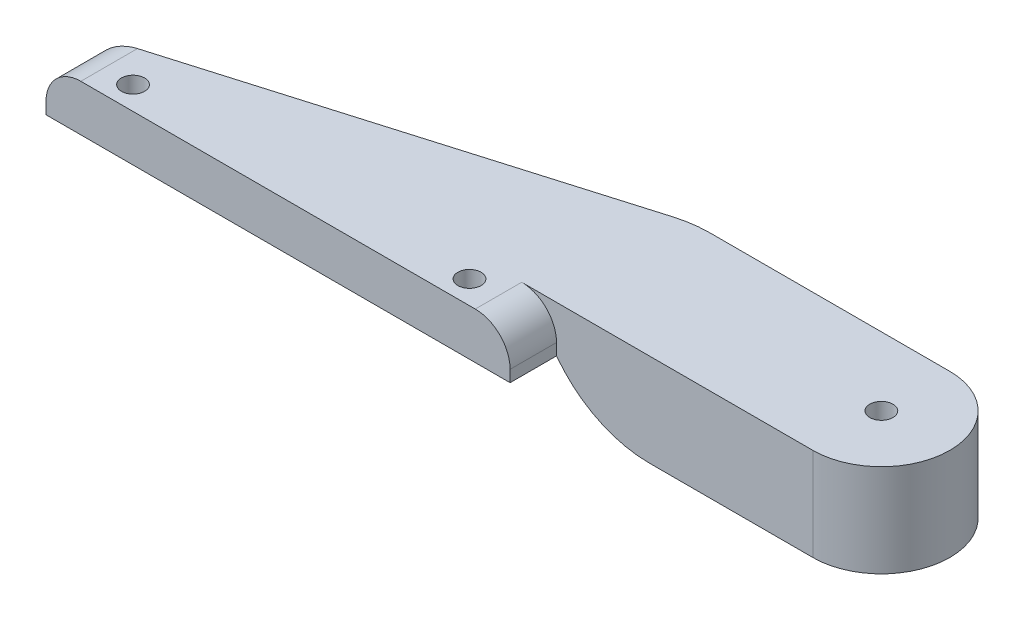
ISO-10303-21;
HEADER;
FILE_DESCRIPTION(('STEP AP214'),'2;1');
FILE_NAME('part.step','',(''),(''),'','','');
FILE_SCHEMA(('AUTOMOTIVE_DESIGN { 1 0 10303 214 1 1 1 1 }'));
ENDSEC;
DATA;
#1=APPLICATION_CONTEXT('core data for automotive mechanical design processes');
#2=APPLICATION_PROTOCOL_DEFINITION('international standard','automotive_design',2000,#1);
#3=PRODUCT_CONTEXT('',#1,'mechanical');
#4=PRODUCT('Part','Part','',(#3));
#5=PRODUCT_RELATED_PRODUCT_CATEGORY('part','',(#4));
#6=PRODUCT_DEFINITION_FORMATION('','',#4);
#7=PRODUCT_DEFINITION_CONTEXT('part definition',#1,'design');
#8=PRODUCT_DEFINITION('design','',#6,#7);
#9=PRODUCT_DEFINITION_SHAPE('','',#8);
#10=(LENGTH_UNIT() NAMED_UNIT(*) SI_UNIT(.MILLI.,.METRE.));
#11=(NAMED_UNIT(*) PLANE_ANGLE_UNIT() SI_UNIT($,.RADIAN.));
#12=(NAMED_UNIT(*) SI_UNIT($,.STERADIAN.) SOLID_ANGLE_UNIT());
#13=UNCERTAINTY_MEASURE_WITH_UNIT(LENGTH_MEASURE(1.E-05),#10,'distance_accuracy_value','');
#14=(GEOMETRIC_REPRESENTATION_CONTEXT(3) GLOBAL_UNCERTAINTY_ASSIGNED_CONTEXT((#13)) GLOBAL_UNIT_ASSIGNED_CONTEXT((#10,
#11,#12)) REPRESENTATION_CONTEXT('',''));
#15=CARTESIAN_POINT('',(0.,0.,0.));
#16=DIRECTION('',(0.,0.,1.));
#17=DIRECTION('',(1.,0.,0.));
#18=AXIS2_PLACEMENT_3D('',#15,#16,#17);
#19=CARTESIAN_POINT('',(20.,4.,-2.));
#20=DIRECTION('',(0.,0.,-1.));
#21=DIRECTION('',(-1.,0.,0.));
#22=AXIS2_PLACEMENT_3D('',#19,#20,#21);
#23=PLANE('',#22);
#24=DIRECTION('',(1.,0.,0.));
#25=VECTOR('',#24,1.);
#26=CARTESIAN_POINT('',(20.,4.,-2.));
#27=LINE('',#26,#25);
#28=CARTESIAN_POINT('',(17.,4.,-2.));
#29=VERTEX_POINT('',#28);
#30=CARTESIAN_POINT('',(42.1,4.,-2.));
#31=VERTEX_POINT('',#30);
#32=EDGE_CURVE('E205',#29,#31,#27,.T.);
#33=ORIENTED_EDGE('',*,*,#32,.F.);
#34=CARTESIAN_POINT('',(17.,1.,-2.));
#35=DIRECTION('',(0.,0.,-1.));
#36=DIRECTION('',(-1.,0.,0.));
#37=AXIS2_PLACEMENT_3D('',#34,#35,#36);
#38=CIRCLE('',#37,3.);
#39=CARTESIAN_POINT('',(20.,1.,-2.));
#40=VERTEX_POINT('',#39);
#41=EDGE_CURVE('E11',#29,#40,#38,.T.);
#42=ORIENTED_EDGE('',*,*,#41,.T.);
#43=DIRECTION('',(0.,-1.,0.));
#44=VECTOR('',#43,1.);
#45=CARTESIAN_POINT('',(20.,4.,-2.));
#46=LINE('',#45,#44);
#47=CARTESIAN_POINT('',(20.,0.,-2.));
#48=VERTEX_POINT('',#47);
#49=EDGE_CURVE('E220',#40,#48,#46,.T.);
#50=ORIENTED_EDGE('',*,*,#49,.T.);
#51=CARTESIAN_POINT('',(28.,6.,-2.));
#52=DIRECTION('',(0.,0.,-1.));
#53=DIRECTION('',(-1.,0.,0.));
#54=AXIS2_PLACEMENT_3D('',#51,#52,#53);
#55=CIRCLE('',#54,10.);
#56=CARTESIAN_POINT('',(28.,-4.,-2.));
#57=VERTEX_POINT('',#56);
#58=EDGE_CURVE('E356',#48,#57,#55,.F.);
#59=ORIENTED_EDGE('',*,*,#58,.T.);
#60=DIRECTION('',(-1.,0.,0.));
#61=VECTOR('',#60,1.);
#62=CARTESIAN_POINT('',(20.,-4.,-2.));
#63=LINE('',#62,#61);
#64=CARTESIAN_POINT('',(42.1,-4.,-2.));
#65=VERTEX_POINT('',#64);
#66=EDGE_CURVE('E199',#65,#57,#63,.T.);
#67=ORIENTED_EDGE('',*,*,#66,.F.);
#68=DIRECTION('',(0.,-1.,0.));
#69=VECTOR('',#68,1.);
#70=CARTESIAN_POINT('',(42.1,4.,-2.));
#71=LINE('',#70,#69);
#72=EDGE_CURVE('E241',#31,#65,#71,.T.);
#73=ORIENTED_EDGE('',*,*,#72,.F.);
#74=EDGE_LOOP('',(#33,#42,#50,#59,#67,#73));
#75=FACE_BOUND('',#74,.T.);
#76=ADVANCED_FACE('F33',(#75),#23,.F.);
#77=CARTESIAN_POINT('',(42.1,4.,-7.9));
#78=DIRECTION('',(0.,-1.,0.));
#79=DIRECTION('',(0.,0.,-1.));
#80=AXIS2_PLACEMENT_3D('',#77,#78,#79);
#81=CYLINDRICAL_SURFACE('',#80,5.9);
#82=ORIENTED_EDGE('',*,*,#72,.T.);
#83=CARTESIAN_POINT('',(42.1,-4.,-7.9));
#84=DIRECTION('',(0.,-1.,0.));
#85=DIRECTION('',(0.,0.,1.));
#86=AXIS2_PLACEMENT_3D('',#83,#84,#85);
#87=CIRCLE('',#86,5.9);
#88=CARTESIAN_POINT('',(42.1,-4.,-13.8));
#89=VERTEX_POINT('',#88);
#90=EDGE_CURVE('E196',#89,#65,#87,.T.);
#91=ORIENTED_EDGE('',*,*,#90,.F.);
#92=DIRECTION('',(0.,-1.,0.));
#93=VECTOR('',#92,1.);
#94=CARTESIAN_POINT('',(42.1,4.,-13.8));
#95=LINE('',#94,#93);
#96=CARTESIAN_POINT('',(42.1,4.,-13.8));
#97=VERTEX_POINT('',#96);
#98=EDGE_CURVE('E238',#97,#89,#95,.T.);
#99=ORIENTED_EDGE('',*,*,#98,.F.);
#100=CARTESIAN_POINT('',(42.1,4.,-7.9));
#101=DIRECTION('',(0.,1.,0.));
#102=DIRECTION('',(0.,0.,-1.));
#103=AXIS2_PLACEMENT_3D('',#100,#101,#102);
#104=CIRCLE('',#103,5.9);
#105=EDGE_CURVE('E208',#31,#97,#104,.T.);
#106=ORIENTED_EDGE('',*,*,#105,.F.);
#107=EDGE_LOOP('',(#82,#91,#99,#106));
#108=FACE_BOUND('',#107,.T.);
#109=ADVANCED_FACE('F313',(#108),#81,.T.);
#110=CARTESIAN_POINT('',(20.,4.,-13.8));
#111=DIRECTION('',(0.,0.,1.));
#112=DIRECTION('',(1.,0.,0.));
#113=AXIS2_PLACEMENT_3D('',#110,#111,#112);
#114=PLANE('',#113);
#115=CARTESIAN_POINT('',(28.,6.,-13.8));
#116=DIRECTION('',(0.,0.,1.));
#117=DIRECTION('',(1.,0.,0.));
#118=AXIS2_PLACEMENT_3D('',#115,#116,#117);
#119=CIRCLE('',#118,10.);
#120=CARTESIAN_POINT('',(28.,-4.,-13.8));
#121=VERTEX_POINT('',#120);
#122=CARTESIAN_POINT('',(21.4442342640121,-1.55128701711487,-13.8));
#123=VERTEX_POINT('',#122);
#124=EDGE_CURVE('E359',#121,#123,#119,.F.);
#125=ORIENTED_EDGE('',*,*,#124,.T.);
#126=DIRECTION('',(0.,-1.,0.));
#127=VECTOR('',#126,1.);
#128=CARTESIAN_POINT('',(21.4442342640121,4.,-13.8));
#129=LINE('',#128,#127);
#130=CARTESIAN_POINT('',(21.4442342640121,4.,-13.8));
#131=VERTEX_POINT('',#130);
#132=EDGE_CURVE('E337',#123,#131,#129,.F.);
#133=ORIENTED_EDGE('',*,*,#132,.T.);
#134=DIRECTION('',(-1.,0.,0.));
#135=VECTOR('',#134,1.);
#136=CARTESIAN_POINT('',(20.,4.,-13.8));
#137=LINE('',#136,#135);
#138=EDGE_CURVE('E211',#97,#131,#137,.T.);
#139=ORIENTED_EDGE('',*,*,#138,.F.);
#140=ORIENTED_EDGE('',*,*,#98,.T.);
#141=DIRECTION('',(1.,0.,0.));
#142=VECTOR('',#141,1.);
#143=CARTESIAN_POINT('',(20.,-4.,-13.8));
#144=LINE('',#143,#142);
#145=EDGE_CURVE('E194',#121,#89,#144,.T.);
#146=ORIENTED_EDGE('',*,*,#145,.F.);
#147=EDGE_LOOP('',(#125,#133,#139,#140,#146));
#148=FACE_BOUND('',#147,.T.);
#149=ADVANCED_FACE('F309',(#148),#114,.F.);
#150=CARTESIAN_POINT('',(-20.,4.,-2.));
#151=DIRECTION('',(0.282945147243684,0.,0.959136092351471));
#152=DIRECTION('',(0.959136092351471,0.,-0.282945147243684));
#153=AXIS2_PLACEMENT_3D('',#150,#151,#152);
#154=PLANE('',#153);
#155=DIRECTION('',(0.,-1.,0.));
#156=VECTOR('',#155,1.);
#157=CARTESIAN_POINT('',(-20.,4.,-2.));
#158=LINE('',#157,#156);
#159=CARTESIAN_POINT('',(-20.,1.,-2.));
#160=VERTEX_POINT('',#159);
#161=CARTESIAN_POINT('',(-20.,0.,-2.));
#162=VERTEX_POINT('',#161);
#163=EDGE_CURVE('E236',#160,#162,#158,.T.);
#164=ORIENTED_EDGE('',*,*,#163,.F.);
#165=CARTESIAN_POINT('',(-17.,1.,-2.885));
#166=DIRECTION('',(0.282945147243684,0.,0.959136092351471));
#167=DIRECTION('',(-0.959136092351471,0.,0.282945147243684));
#168=AXIS2_PLACEMENT_3D('',#165,#166,#167);
#169=ELLIPSE('',#168,3.12781473236507,3.);
#170=CARTESIAN_POINT('',(-17.,4.,-2.885));
#171=VERTEX_POINT('',#170);
#172=EDGE_CURVE('E345',#160,#171,#169,.F.);
#173=ORIENTED_EDGE('',*,*,#172,.T.);
#174=DIRECTION('',(-0.959136092351471,0.,0.282945147243684));
#175=VECTOR('',#174,1.);
#176=CARTESIAN_POINT('',(-20.,4.,-2.));
#177=LINE('',#176,#175);
#178=CARTESIAN_POINT('',(18.6147827915753,4.,-13.3913609235147));
#179=VERTEX_POINT('',#178);
#180=EDGE_CURVE('E214',#179,#171,#177,.T.);
#181=ORIENTED_EDGE('',*,*,#180,.F.);
#182=DIRECTION('',(0.,-1.,0.));
#183=VECTOR('',#182,1.);
#184=CARTESIAN_POINT('',(18.6147827915753,4.,-13.3913609235147));
#185=LINE('',#184,#183);
#186=CARTESIAN_POINT('',(18.6147827915753,0.,-13.3913609235147));
#187=VERTEX_POINT('',#186);
#188=EDGE_CURVE('E358',#179,#187,#185,.T.);
#189=ORIENTED_EDGE('',*,*,#188,.T.);
#190=DIRECTION('',(-0.959136092351471,0.,0.282945147243684));
#191=VECTOR('',#190,1.);
#192=CARTESIAN_POINT('',(-20.,0.,-2.));
#193=LINE('',#192,#191);
#194=EDGE_CURVE('E202',#187,#162,#193,.T.);
#195=ORIENTED_EDGE('',*,*,#194,.T.);
#196=EDGE_LOOP('',(#164,#173,#181,#189,#195));
#197=FACE_BOUND('',#196,.T.);
#198=ADVANCED_FACE('F306',(#197),#154,.F.);
#199=CARTESIAN_POINT('',(-20.,4.,2.));
#200=DIRECTION('',(1.,0.,0.));
#201=DIRECTION('',(0.,0.,-1.));
#202=AXIS2_PLACEMENT_3D('',#199,#200,#201);
#203=PLANE('',#202);
#204=DIRECTION('',(0.,-1.,0.));
#205=VECTOR('',#204,1.);
#206=CARTESIAN_POINT('',(-20.,4.,2.));
#207=LINE('',#206,#205);
#208=CARTESIAN_POINT('',(-20.,1.,2.));
#209=VERTEX_POINT('',#208);
#210=CARTESIAN_POINT('',(-20.,0.,2.));
#211=VERTEX_POINT('',#210);
#212=EDGE_CURVE('E234',#209,#211,#207,.T.);
#213=ORIENTED_EDGE('',*,*,#212,.F.);
#214=DIRECTION('',(0.,0.,1.));
#215=VECTOR('',#214,1.);
#216=CARTESIAN_POINT('',(-20.,1.,2.));
#217=LINE('',#216,#215);
#218=EDGE_CURVE('E54',#209,#160,#217,.F.);
#219=ORIENTED_EDGE('',*,*,#218,.T.);
#220=ORIENTED_EDGE('',*,*,#163,.T.);
#221=DIRECTION('',(0.,0.,1.));
#222=VECTOR('',#221,1.);
#223=CARTESIAN_POINT('',(-20.,0.,2.));
#224=LINE('',#223,#222);
#225=EDGE_CURVE('E223',#162,#211,#224,.T.);
#226=ORIENTED_EDGE('',*,*,#225,.T.);
#227=EDGE_LOOP('',(#213,#219,#220,#226));
#228=FACE_BOUND('',#227,.T.);
#229=ADVANCED_FACE('F302',(#228),#203,.F.);
#230=CARTESIAN_POINT('',(-20.,4.,2.));
#231=DIRECTION('',(0.,0.,-1.));
#232=DIRECTION('',(-1.,0.,0.));
#233=AXIS2_PLACEMENT_3D('',#230,#231,#232);
#234=PLANE('',#233);
#235=DIRECTION('',(1.,0.,0.));
#236=VECTOR('',#235,1.);
#237=CARTESIAN_POINT('',(-20.,4.,2.));
#238=LINE('',#237,#236);
#239=CARTESIAN_POINT('',(-17.,4.,2.));
#240=VERTEX_POINT('',#239);
#241=CARTESIAN_POINT('',(17.,4.,2.));
#242=VERTEX_POINT('',#241);
#243=EDGE_CURVE('E217',#240,#242,#238,.T.);
#244=ORIENTED_EDGE('',*,*,#243,.F.);
#245=CARTESIAN_POINT('',(-17.,1.,2.));
#246=DIRECTION('',(0.,0.,-1.));
#247=DIRECTION('',(-1.,0.,0.));
#248=AXIS2_PLACEMENT_3D('',#245,#246,#247);
#249=CIRCLE('',#248,3.);
#250=EDGE_CURVE('E342',#240,#209,#249,.F.);
#251=ORIENTED_EDGE('',*,*,#250,.T.);
#252=ORIENTED_EDGE('',*,*,#212,.T.);
#253=DIRECTION('',(1.,0.,0.));
#254=VECTOR('',#253,1.);
#255=CARTESIAN_POINT('',(-20.,0.,2.));
#256=LINE('',#255,#254);
#257=CARTESIAN_POINT('',(20.,0.,2.));
#258=VERTEX_POINT('',#257);
#259=EDGE_CURVE('E226',#211,#258,#256,.T.);
#260=ORIENTED_EDGE('',*,*,#259,.T.);
#261=DIRECTION('',(0.,-1.,0.));
#262=VECTOR('',#261,1.);
#263=CARTESIAN_POINT('',(20.,4.,2.));
#264=LINE('',#263,#262);
#265=CARTESIAN_POINT('',(20.,1.,2.));
#266=VERTEX_POINT('',#265);
#267=EDGE_CURVE('E232',#266,#258,#264,.T.);
#268=ORIENTED_EDGE('',*,*,#267,.F.);
#269=CARTESIAN_POINT('',(17.,1.,2.));
#270=DIRECTION('',(0.,0.,-1.));
#271=DIRECTION('',(-1.,0.,0.));
#272=AXIS2_PLACEMENT_3D('',#269,#270,#271);
#273=CIRCLE('',#272,3.);
#274=EDGE_CURVE('E335',#266,#242,#273,.F.);
#275=ORIENTED_EDGE('',*,*,#274,.T.);
#276=EDGE_LOOP('',(#244,#251,#252,#260,#268,#275));
#277=FACE_BOUND('',#276,.T.);
#278=ADVANCED_FACE('F298',(#277),#234,.F.);
#279=CARTESIAN_POINT('',(20.,4.,2.));
#280=DIRECTION('',(-1.,0.,0.));
#281=DIRECTION('',(0.,0.,1.));
#282=AXIS2_PLACEMENT_3D('',#279,#280,#281);
#283=PLANE('',#282);
#284=ORIENTED_EDGE('',*,*,#49,.F.);
#285=DIRECTION('',(0.,0.,-1.));
#286=VECTOR('',#285,1.);
#287=CARTESIAN_POINT('',(20.,1.,2.));
#288=LINE('',#287,#286);
#289=EDGE_CURVE('E41',#40,#266,#288,.F.);
#290=ORIENTED_EDGE('',*,*,#289,.T.);
#291=ORIENTED_EDGE('',*,*,#267,.T.);
#292=DIRECTION('',(0.,0.,-1.));
#293=VECTOR('',#292,1.);
#294=CARTESIAN_POINT('',(20.,0.,2.));
#295=LINE('',#294,#293);
#296=EDGE_CURVE('E209',#258,#48,#295,.T.);
#297=ORIENTED_EDGE('',*,*,#296,.T.);
#298=EDGE_LOOP('',(#284,#290,#291,#297));
#299=FACE_BOUND('',#298,.T.);
#300=ADVANCED_FACE('F291',(#299),#283,.F.);
#301=CARTESIAN_POINT('',(42.1,4.,-7.9));
#302=DIRECTION('',(0.,-1.,0.));
#303=DIRECTION('',(0.,0.,-1.));
#304=AXIS2_PLACEMENT_3D('',#301,#302,#303);
#305=PLANE('',#304);
#306=CARTESIAN_POINT('',(14.5,4.,0.));
#307=DIRECTION('',(0.,1.,0.));
#308=DIRECTION('',(0.,0.,1.));
#309=AXIS2_PLACEMENT_3D('',#306,#307,#308);
#310=CIRCLE('',#309,1.);
#311=CARTESIAN_POINT('',(14.5,4.,1.));
#312=VERTEX_POINT('',#311);
#313=EDGE_CURVE('E251',#312,#312,#310,.T.);
#314=ORIENTED_EDGE('',*,*,#313,.F.);
#315=EDGE_LOOP('',(#314));
#316=FACE_BOUND('',#315,.T.);
#317=CARTESIAN_POINT('',(-14.5,4.,0.));
#318=DIRECTION('',(0.,1.,0.));
#319=DIRECTION('',(0.,0.,1.));
#320=AXIS2_PLACEMENT_3D('',#317,#318,#319);
#321=CIRCLE('',#320,1.);
#322=CARTESIAN_POINT('',(-14.5,4.,1.));
#323=VERTEX_POINT('',#322);
#324=EDGE_CURVE('E247',#323,#323,#321,.T.);
#325=ORIENTED_EDGE('',*,*,#324,.F.);
#326=EDGE_LOOP('',(#325));
#327=FACE_BOUND('',#326,.T.);
#328=CARTESIAN_POINT('',(42.1,4.,-7.9));
#329=DIRECTION('',(0.,-1.,0.));
#330=DIRECTION('',(0.,0.,-1.));
#331=AXIS2_PLACEMENT_3D('',#328,#329,#330);
#332=CIRCLE('',#331,0.999999999999998);
#333=CARTESIAN_POINT('',(42.1,4.,-8.9));
#334=VERTEX_POINT('',#333);
#335=EDGE_CURVE('E185',#334,#334,#332,.T.);
#336=ORIENTED_EDGE('',*,*,#335,.T.);
#337=EDGE_LOOP('',(#336));
#338=FACE_BOUND('',#337,.T.);
#339=ORIENTED_EDGE('',*,*,#180,.T.);
#340=DIRECTION('',(0.,0.,1.));
#341=VECTOR('',#340,1.);
#342=CARTESIAN_POINT('',(-17.,4.,-7.9));
#343=LINE('',#342,#341);
#344=EDGE_CURVE('E332',#171,#240,#343,.T.);
#345=ORIENTED_EDGE('',*,*,#344,.T.);
#346=ORIENTED_EDGE('',*,*,#243,.T.);
#347=DIRECTION('',(0.,0.,-1.));
#348=VECTOR('',#347,1.);
#349=CARTESIAN_POINT('',(17.,4.,-7.9));
#350=LINE('',#349,#348);
#351=EDGE_CURVE('E329',#242,#29,#350,.T.);
#352=ORIENTED_EDGE('',*,*,#351,.T.);
#353=ORIENTED_EDGE('',*,*,#32,.T.);
#354=ORIENTED_EDGE('',*,*,#105,.T.);
#355=ORIENTED_EDGE('',*,*,#138,.T.);
#356=CARTESIAN_POINT('',(21.4442342640121,4.,-3.8));
#357=DIRECTION('',(0.,-1.,0.));
#358=DIRECTION('',(0.,0.,-1.));
#359=AXIS2_PLACEMENT_3D('',#356,#357,#358);
#360=CIRCLE('',#359,10.);
#361=EDGE_CURVE('E333',#131,#179,#360,.F.);
#362=ORIENTED_EDGE('',*,*,#361,.T.);
#363=EDGE_LOOP('',(#339,#345,#346,#352,#353,#354,#355,#362));
#364=FACE_BOUND('',#363,.T.);
#365=ADVANCED_FACE('F288',(#316,#327,#338,#364),#305,.F.);
#366=CARTESIAN_POINT('',(42.1,0.,-7.9));
#367=DIRECTION('',(0.,-1.,0.));
#368=DIRECTION('',(0.,0.,-1.));
#369=AXIS2_PLACEMENT_3D('',#366,#367,#368);
#370=PLANE('',#369);
#371=CARTESIAN_POINT('',(14.5,0.,0.));
#372=DIRECTION('',(0.,-1.,0.));
#373=DIRECTION('',(0.,0.,-1.));
#374=AXIS2_PLACEMENT_3D('',#371,#372,#373);
#375=CIRCLE('',#374,1.);
#376=CARTESIAN_POINT('',(14.5,0.,-0.999999999999999));
#377=VERTEX_POINT('',#376);
#378=EDGE_CURVE('E248',#377,#377,#375,.T.);
#379=ORIENTED_EDGE('',*,*,#378,.F.);
#380=EDGE_LOOP('',(#379));
#381=FACE_BOUND('',#380,.T.);
#382=CARTESIAN_POINT('',(-14.5,0.,0.));
#383=DIRECTION('',(0.,-1.,0.));
#384=DIRECTION('',(0.,0.,-1.));
#385=AXIS2_PLACEMENT_3D('',#382,#383,#384);
#386=CIRCLE('',#385,1.);
#387=CARTESIAN_POINT('',(-14.5,0.,-0.999999999999995));
#388=VERTEX_POINT('',#387);
#389=EDGE_CURVE('E244',#388,#388,#386,.T.);
#390=ORIENTED_EDGE('',*,*,#389,.F.);
#391=EDGE_LOOP('',(#390));
#392=FACE_BOUND('',#391,.T.);
#393=ORIENTED_EDGE('',*,*,#194,.F.);
#394=CARTESIAN_POINT('',(21.4442342640121,0.,-3.8));
#395=DIRECTION('',(0.,-1.,0.));
#396=DIRECTION('',(0.,0.,-1.));
#397=AXIS2_PLACEMENT_3D('',#394,#395,#396);
#398=CIRCLE('',#397,10.);
#399=CARTESIAN_POINT('',(20.,0.,-13.6951597961151));
#400=VERTEX_POINT('',#399);
#401=EDGE_CURVE('E362',#187,#400,#398,.T.);
#402=ORIENTED_EDGE('',*,*,#401,.T.);
#403=DIRECTION('',(0.,0.,-1.));
#404=VECTOR('',#403,1.);
#405=CARTESIAN_POINT('',(20.,0.,-2.));
#406=LINE('',#405,#404);
#407=EDGE_CURVE('E189',#48,#400,#406,.T.);
#408=ORIENTED_EDGE('',*,*,#407,.F.);
#409=ORIENTED_EDGE('',*,*,#296,.F.);
#410=ORIENTED_EDGE('',*,*,#259,.F.);
#411=ORIENTED_EDGE('',*,*,#225,.F.);
#412=EDGE_LOOP('',(#393,#402,#408,#409,#410,#411));
#413=FACE_BOUND('',#412,.T.);
#414=ADVANCED_FACE('F286',(#381,#392,#413),#370,.T.);
#415=CARTESIAN_POINT('',(42.1,-4.,-7.9));
#416=DIRECTION('',(0.,1.,0.));
#417=DIRECTION('',(0.,0.,1.));
#418=AXIS2_PLACEMENT_3D('',#415,#416,#417);
#419=PLANE('',#418);
#420=ORIENTED_EDGE('',*,*,#66,.T.);
#421=DIRECTION('',(0.,0.,-1.));
#422=VECTOR('',#421,1.);
#423=CARTESIAN_POINT('',(28.,-4.,-7.9));
#424=LINE('',#423,#422);
#425=CARTESIAN_POINT('',(28.,-4.,-5.90552618459344));
#426=VERTEX_POINT('',#425);
#427=EDGE_CURVE('E253',#57,#426,#424,.T.);
#428=ORIENTED_EDGE('',*,*,#427,.T.);
#429=DIRECTION('',(-0.996448898518601,0.,-0.0841997187707063));
#430=VECTOR('',#429,1.);
#431=CARTESIAN_POINT('',(39.8997482853627,-4.,-4.90000000000001));
#432=LINE('',#431,#430);
#433=CARTESIAN_POINT('',(39.8997482853627,-4.,-4.90000000000001));
#434=VERTEX_POINT('',#433);
#435=EDGE_CURVE('E176',#434,#426,#432,.T.);
#436=ORIENTED_EDGE('',*,*,#435,.F.);
#437=CARTESIAN_POINT('',(42.1,-4.,-7.9));
#438=DIRECTION('',(0.,-1.,0.));
#439=DIRECTION('',(0.,0.,1.));
#440=AXIS2_PLACEMENT_3D('',#437,#438,#439);
#441=CIRCLE('',#440,3.72036390797518);
#442=CARTESIAN_POINT('',(39.8677816552149,-4.,-10.8762911263801));
#443=VERTEX_POINT('',#442);
#444=EDGE_CURVE('E156',#443,#434,#441,.T.);
#445=ORIENTED_EDGE('',*,*,#444,.F.);
#446=DIRECTION('',(0.996595142359569,0.,-0.0824507260447701));
#447=VECTOR('',#446,1.);
#448=CARTESIAN_POINT('',(27.9813488478213,-4.,-9.8928977970372));
#449=LINE('',#448,#447);
#450=CARTESIAN_POINT('',(28.,-4.,-9.89444085195824));
#451=VERTEX_POINT('',#450);
#452=EDGE_CURVE('E174',#451,#443,#449,.T.);
#453=ORIENTED_EDGE('',*,*,#452,.F.);
#454=DIRECTION('',(0.,0.,-1.));
#455=VECTOR('',#454,1.);
#456=CARTESIAN_POINT('',(28.,-4.,-7.9));
#457=LINE('',#456,#455);
#458=EDGE_CURVE('E243',#451,#121,#457,.T.);
#459=ORIENTED_EDGE('',*,*,#458,.T.);
#460=ORIENTED_EDGE('',*,*,#145,.T.);
#461=ORIENTED_EDGE('',*,*,#90,.T.);
#462=EDGE_LOOP('',(#420,#428,#436,#445,#453,#459,#460,#461));
#463=FACE_BOUND('',#462,.T.);
#464=ADVANCED_FACE('F283',(#463),#419,.F.);
#465=CARTESIAN_POINT('',(42.1,0.,-7.9));
#466=DIRECTION('',(0.,-1.,0.));
#467=DIRECTION('',(0.,0.,-1.));
#468=AXIS2_PLACEMENT_3D('',#465,#466,#467);
#469=CYLINDRICAL_SURFACE('',#468,3.72036390797518);
#470=ORIENTED_EDGE('',*,*,#444,.T.);
#471=DIRECTION('',(0.,-1.,0.));
#472=VECTOR('',#471,1.);
#473=CARTESIAN_POINT('',(39.8997482853627,0.,-4.90000000000001));
#474=LINE('',#473,#472);
#475=CARTESIAN_POINT('',(39.8997482853627,0.,-4.90000000000001));
#476=VERTEX_POINT('',#475);
#477=EDGE_CURVE('E148',#476,#434,#474,.T.);
#478=ORIENTED_EDGE('',*,*,#477,.F.);
#479=CARTESIAN_POINT('',(42.1,0.,-7.9));
#480=DIRECTION('',(0.,-1.,0.));
#481=DIRECTION('',(0.,0.,1.));
#482=AXIS2_PLACEMENT_3D('',#479,#480,#481);
#483=CIRCLE('',#482,3.72036390797518);
#484=CARTESIAN_POINT('',(39.8677816552149,0.,-10.8762911263801));
#485=VERTEX_POINT('',#484);
#486=EDGE_CURVE('E153',#485,#476,#483,.T.);
#487=ORIENTED_EDGE('',*,*,#486,.F.);
#488=DIRECTION('',(0.,-1.,0.));
#489=VECTOR('',#488,1.);
#490=CARTESIAN_POINT('',(39.8677816552149,0.,-10.8762911263801));
#491=LINE('',#490,#489);
#492=EDGE_CURVE('E187',#485,#443,#491,.T.);
#493=ORIENTED_EDGE('',*,*,#492,.T.);
#494=EDGE_LOOP('',(#470,#478,#487,#493));
#495=FACE_BOUND('',#494,.T.);
#496=ADVANCED_FACE('F150',(#495),#469,.F.);
#497=CARTESIAN_POINT('',(27.9813488478213,0.,-9.8928977970372));
#498=DIRECTION('',(-0.0824507260447701,0.,-0.996595142359569));
#499=DIRECTION('',(-0.996595142359569,0.,0.0824507260447701));
#500=AXIS2_PLACEMENT_3D('',#497,#498,#499);
#501=PLANE('',#500);
#502=DIRECTION('',(0.,-1.,0.));
#503=VECTOR('',#502,1.);
#504=CARTESIAN_POINT('',(27.9813488478213,0.,-9.8928977970372));
#505=LINE('',#504,#503);
#506=CARTESIAN_POINT('',(27.9813488478213,0.,-9.8928977970372));
#507=VERTEX_POINT('',#506);
#508=CARTESIAN_POINT('',(27.9813488478213,-3.999982606711,-9.8928977970372));
#509=VERTEX_POINT('',#508);
#510=EDGE_CURVE('E190',#507,#509,#505,.T.);
#511=ORIENTED_EDGE('',*,*,#510,.T.);
#512=CARTESIAN_POINT('',(28.,6.,-9.89444085195824));
#513=DIRECTION('',(-0.0824507260447701,0.,-0.996595142359569));
#514=DIRECTION('',(0.996595142359569,0.,-0.0824507260447701));
#515=AXIS2_PLACEMENT_3D('',#512,#513,#514);
#516=ELLIPSE('',#515,10.0341649030354,10.);
#517=EDGE_CURVE('E265',#509,#451,#516,.F.);
#518=ORIENTED_EDGE('',*,*,#517,.T.);
#519=ORIENTED_EDGE('',*,*,#452,.T.);
#520=ORIENTED_EDGE('',*,*,#492,.F.);
#521=DIRECTION('',(0.996595142359569,0.,-0.0824507260447701));
#522=VECTOR('',#521,1.);
#523=CARTESIAN_POINT('',(27.9813488478213,0.,-9.8928977970372));
#524=LINE('',#523,#522);
#525=EDGE_CURVE('E161',#507,#485,#524,.T.);
#526=ORIENTED_EDGE('',*,*,#525,.F.);
#527=EDGE_LOOP('',(#511,#518,#519,#520,#526));
#528=FACE_BOUND('',#527,.T.);
#529=ADVANCED_FACE('F276',(#528),#501,.F.);
#530=CARTESIAN_POINT('',(27.9813488478213,0.,-7.9));
#531=DIRECTION('',(0.,-1.,0.));
#532=DIRECTION('',(0.,0.,-1.));
#533=AXIS2_PLACEMENT_3D('',#530,#531,#532);
#534=CYLINDRICAL_SURFACE('',#533,1.9928977970372);
#535=DIRECTION('',(0.,-1.,0.));
#536=VECTOR('',#535,1.);
#537=CARTESIAN_POINT('',(27.9813488478213,0.,-5.9071022029628));
#538=LINE('',#537,#536);
#539=CARTESIAN_POINT('',(27.9813488478213,0.,-5.9071022029628));
#540=VERTEX_POINT('',#539);
#541=CARTESIAN_POINT('',(27.9813488478213,-3.99998260671099,-5.9071022029628));
#542=VERTEX_POINT('',#541);
#543=EDGE_CURVE('E160',#540,#542,#538,.T.);
#544=ORIENTED_EDGE('',*,*,#543,.T.);
#545=CARTESIAN_POINT('',(27.9813488478213,-3.99998260671099,-5.9071022029628));
#546=CARTESIAN_POINT('',(27.9258510275741,-3.99988165396656,-5.90710194102415));
#547=CARTESIAN_POINT('',(27.8703812202983,-3.99931306187351,-5.90942191006826));
#548=CARTESIAN_POINT('',(27.7598508801047,-3.99726843852848,-5.91867260954471));
#549=CARTESIAN_POINT('',(27.7047902990594,-3.99579251574957,-5.92560278882594));
#550=CARTESIAN_POINT('',(27.5409921553846,-3.99005439887119,-5.95322110566567));
#551=CARTESIAN_POINT('',(27.4333711140772,-3.98448110248227,-5.98073735239698));
#552=CARTESIAN_POINT('',(27.2243964088102,-3.97042836828233,-6.05313416238933));
#553=CARTESIAN_POINT('',(27.1230435526733,-3.9619485568069,-6.09801695840649));
#554=CARTESIAN_POINT('',(26.9292836246916,-3.94298979104082,-6.20383338779688));
#555=CARTESIAN_POINT('',(26.8368773619399,-3.93251065619373,-6.26476847102181));
#556=CARTESIAN_POINT('',(26.6624196340006,-3.91053563107475,-6.40182677692127));
#557=CARTESIAN_POINT('',(26.5805066309352,-3.89902899415347,-6.47812446221077));
#558=CARTESIAN_POINT('',(26.4305462218908,-3.87636467969978,-6.64337609969289));
#559=CARTESIAN_POINT('',(26.3625010989788,-3.86520705988153,-6.73233213174029));
#560=CARTESIAN_POINT('',(26.2416418722682,-3.84438846062123,-6.92135064324997));
#561=CARTESIAN_POINT('',(26.1889684630977,-3.83474165916513,-7.02150477831095));
#562=CARTESIAN_POINT('',(26.1012550535045,-3.81818581909149,-7.22946329071962));
#563=CARTESIAN_POINT('',(26.0662123109566,-3.81127635476719,-7.33726647542083));
#564=CARTESIAN_POINT('',(26.0152099968558,-3.80108578775166,-7.55594238789587));
#565=CARTESIAN_POINT('',(25.9990017494893,-3.79775744732315,-7.66675487157657));
#566=CARTESIAN_POINT('',(25.9853556592355,-3.79496096083764,-7.88957510642981));
#567=CARTESIAN_POINT('',(25.9879163177958,-3.79549250659849,-8.00158276146413));
#568=CARTESIAN_POINT('',(26.0115368713923,-3.80031381647305,-8.22181102815697));
#569=CARTESIAN_POINT('',(26.0323147346988,-3.80454628171638,-8.33006332978189));
#570=CARTESIAN_POINT('',(26.0913347123552,-3.81620565111392,-8.54151264181261));
#571=CARTESIAN_POINT('',(26.1295775364254,-3.82363268508447,-8.64470944659046));
#572=CARTESIAN_POINT('',(26.2227120372125,-3.84090922650513,-8.84393506649912));
#573=CARTESIAN_POINT('',(26.2777159482339,-3.85077497711707,-8.93990994710387));
#574=CARTESIAN_POINT('',(26.4027293747535,-3.87181503424319,-9.12136975261098));
#575=CARTESIAN_POINT('',(26.4727401414134,-3.88298944982902,-9.20685380192956));
#576=CARTESIAN_POINT('',(26.6272840916004,-3.90564724024965,-9.36653241589454));
#577=CARTESIAN_POINT('',(26.712057062607,-3.91713254744761,-9.44049479384663));
#578=CARTESIAN_POINT('',(26.8929526761989,-3.93895018908326,-9.57320619019172));
#579=CARTESIAN_POINT('',(26.9890784140747,-3.94928220758052,-9.63195104557661));
#580=CARTESIAN_POINT('',(27.1902461470266,-3.96767391018432,-9.73261721516738));
#581=CARTESIAN_POINT('',(27.2953085967962,-3.97572818837757,-9.77449860428989));
#582=CARTESIAN_POINT('',(27.5111074721538,-3.98862398161702,-9.83989248972452));
#583=CARTESIAN_POINT('',(27.6218352356923,-3.99347025225709,-9.86343218522772));
#584=CARTESIAN_POINT('',(27.7747659773833,-3.99754878146619,-9.88259709412622));
#585=CARTESIAN_POINT('',(27.8160198167955,-3.99839316703429,-9.88646117823068));
#586=CARTESIAN_POINT('',(27.8986256987735,-3.99957105039617,-9.89160828498508));
#587=CARTESIAN_POINT('',(27.9399774586554,-3.99990540681572,-9.89289564664866));
#588=CARTESIAN_POINT('',(27.9813488478213,-3.99998260671099,-9.89289779703721));
#589=B_SPLINE_CURVE_WITH_KNOTS('',3,(#545,#546,#547,#548,#549,#550,#551,#552,#553,#554,#555,
#556,#557,#558,#559,#560,#561,#562,#563,#564,#565,#566,#567,#568,#569,#570,#571,#572,#573,#574,
#575,#576,#577,#578,#579,#580,#581,#582,#583,#584,#585,#586,#587,#588),.UNSPECIFIED.,.F.,.F.,(4,
2,2,2,2,2,2,2,2,2,2,2,2,2,2,2,2,2,2,2,2,4),(0.,0.166389727496478,0.332759566657646,
0.664708361731412,0.996699848481651,1.32872133117863,1.66475077532479,2.00083549534336,
2.33990623246663,2.67892421707287,3.01341330598942,3.34787568882422,3.67724971145934,
4.00663711999251,4.3382805077454,4.66995155625882,5.00762219789693,5.34538511767149,
5.68394307098988,6.0219980107199,6.14626282314149,6.27031820599306),.UNSPECIFIED.);
#590=EDGE_CURVE('E258',#542,#509,#589,.T.);
#591=ORIENTED_EDGE('',*,*,#590,.T.);
#592=ORIENTED_EDGE('',*,*,#510,.F.);
#593=CARTESIAN_POINT('',(27.9813488478213,0.,-7.9));
#594=DIRECTION('',(0.,-1.,0.));
#595=DIRECTION('',(0.,0.,-1.));
#596=AXIS2_PLACEMENT_3D('',#593,#594,#595);
#597=CIRCLE('',#596,1.9928977970372);
#598=EDGE_CURVE('E170',#540,#507,#597,.T.);
#599=ORIENTED_EDGE('',*,*,#598,.F.);
#600=EDGE_LOOP('',(#544,#591,#592,#599));
#601=FACE_BOUND('',#600,.T.);
#602=ADVANCED_FACE('F271',(#601),#534,.F.);
#603=CARTESIAN_POINT('',(39.8997482853627,0.,-4.90000000000001));
#604=DIRECTION('',(-0.0841997187707063,0.,0.996448898518601));
#605=DIRECTION('',(0.996448898518601,0.,0.0841997187707063));
#606=AXIS2_PLACEMENT_3D('',#603,#604,#605);
#607=PLANE('',#606);
#608=ORIENTED_EDGE('',*,*,#435,.T.);
#609=CARTESIAN_POINT('',(28.,6.,-5.90552618459344));
#610=DIRECTION('',(-0.0841997187707063,0.,0.996448898518601));
#611=DIRECTION('',(-0.996448898518601,0.,-0.0841997187707063));
#612=AXIS2_PLACEMENT_3D('',#609,#610,#611);
#613=ELLIPSE('',#612,10.0356375674325,10.);
#614=EDGE_CURVE('E256',#426,#542,#613,.F.);
#615=ORIENTED_EDGE('',*,*,#614,.T.);
#616=ORIENTED_EDGE('',*,*,#543,.F.);
#617=DIRECTION('',(-0.996448898518601,0.,-0.0841997187707063));
#618=VECTOR('',#617,1.);
#619=CARTESIAN_POINT('',(39.8997482853627,0.,-4.90000000000001));
#620=LINE('',#619,#618);
#621=EDGE_CURVE('E164',#476,#540,#620,.T.);
#622=ORIENTED_EDGE('',*,*,#621,.F.);
#623=ORIENTED_EDGE('',*,*,#477,.T.);
#624=EDGE_LOOP('',(#608,#615,#616,#622,#623));
#625=FACE_BOUND('',#624,.T.);
#626=ADVANCED_FACE('F165',(#625),#607,.F.);
#627=CARTESIAN_POINT('',(42.1,0.,-7.9));
#628=DIRECTION('',(0.,1.,0.));
#629=DIRECTION('',(0.,0.,1.));
#630=AXIS2_PLACEMENT_3D('',#627,#628,#629);
#631=PLANE('',#630);
#632=CARTESIAN_POINT('',(42.1,0.,-7.9));
#633=DIRECTION('',(0.,-1.,0.));
#634=DIRECTION('',(0.,0.,-1.));
#635=AXIS2_PLACEMENT_3D('',#632,#633,#634);
#636=CIRCLE('',#635,0.999999999999998);
#637=CARTESIAN_POINT('',(42.1,0.,-8.9));
#638=VERTEX_POINT('',#637);
#639=EDGE_CURVE('E179',#638,#638,#636,.T.);
#640=ORIENTED_EDGE('',*,*,#639,.F.);
#641=EDGE_LOOP('',(#640));
#642=FACE_BOUND('',#641,.T.);
#643=ORIENTED_EDGE('',*,*,#486,.T.);
#644=ORIENTED_EDGE('',*,*,#621,.T.);
#645=ORIENTED_EDGE('',*,*,#598,.T.);
#646=ORIENTED_EDGE('',*,*,#525,.T.);
#647=EDGE_LOOP('',(#643,#644,#645,#646));
#648=FACE_BOUND('',#647,.T.);
#649=ADVANCED_FACE('F172',(#642,#648),#631,.F.);
#650=CARTESIAN_POINT('',(42.1,4.,-7.9));
#651=DIRECTION('',(0.,-1.,0.));
#652=DIRECTION('',(0.,0.,-1.));
#653=AXIS2_PLACEMENT_3D('',#650,#651,#652);
#654=CYLINDRICAL_SURFACE('',#653,0.999999999999998);
#655=ORIENTED_EDGE('',*,*,#335,.F.);
#656=EDGE_LOOP('',(#655));
#657=FACE_BOUND('',#656,.T.);
#658=ORIENTED_EDGE('',*,*,#639,.T.);
#659=EDGE_LOOP('',(#658));
#660=FACE_BOUND('',#659,.T.);
#661=ADVANCED_FACE('F519',(#657,#660),#654,.F.);
#662=CARTESIAN_POINT('',(-14.5,-4.,0.));
#663=DIRECTION('',(0.,1.,0.));
#664=DIRECTION('',(0.,0.,1.));
#665=AXIS2_PLACEMENT_3D('',#662,#663,#664);
#666=CYLINDRICAL_SURFACE('',#665,1.);
#667=ORIENTED_EDGE('',*,*,#389,.T.);
#668=EDGE_LOOP('',(#667));
#669=FACE_BOUND('',#668,.T.);
#670=ORIENTED_EDGE('',*,*,#324,.T.);
#671=EDGE_LOOP('',(#670));
#672=FACE_BOUND('',#671,.T.);
#673=ADVANCED_FACE('F527',(#669,#672),#666,.F.);
#674=CARTESIAN_POINT('',(14.5,-4.,0.));
#675=DIRECTION('',(0.,1.,0.));
#676=DIRECTION('',(0.,0.,1.));
#677=AXIS2_PLACEMENT_3D('',#674,#675,#676);
#678=CYLINDRICAL_SURFACE('',#677,1.);
#679=ORIENTED_EDGE('',*,*,#378,.T.);
#680=EDGE_LOOP('',(#679));
#681=FACE_BOUND('',#680,.T.);
#682=ORIENTED_EDGE('',*,*,#313,.T.);
#683=EDGE_LOOP('',(#682));
#684=FACE_BOUND('',#683,.T.);
#685=ADVANCED_FACE('F428',(#681,#684),#678,.F.);
#686=CARTESIAN_POINT('',(28.,6.,-2.));
#687=DIRECTION('',(0.,0.,-1.));
#688=DIRECTION('',(-1.,0.,0.));
#689=AXIS2_PLACEMENT_3D('',#686,#687,#688);
#690=CYLINDRICAL_SURFACE('',#689,10.);
#691=ORIENTED_EDGE('',*,*,#407,.T.);
#692=CARTESIAN_POINT('',(20.,0.,-13.6951597961151));
#693=CARTESIAN_POINT('',(20.1060951658003,-0.141467480635537,-13.7106436952734));
#694=CARTESIAN_POINT('',(20.2160201813569,-0.28020919663875,-13.7249458944483));
#695=CARTESIAN_POINT('',(20.4428522574238,-0.551384844569867,-13.7503880999004));
#696=CARTESIAN_POINT('',(20.5597352414056,-0.683837968348032,-13.7615383214349));
#697=CARTESIAN_POINT('',(20.8005113425667,-0.94251957566152,-13.7799896463301));
#698=CARTESIAN_POINT('',(20.9244048021633,-1.06874775458316,-13.7872905614964));
#699=CARTESIAN_POINT('',(21.179220018946,-1.31494987509833,-13.7973040201837));
#700=CARTESIAN_POINT('',(21.3101635586314,-1.43490187344799,-13.8000013886111));
#701=CARTESIAN_POINT('',(21.4442342640121,-1.55128701711487,-13.8));
#702=B_SPLINE_CURVE_WITH_KNOTS('',3,(#692,#693,#694,#695,#696,#697,#698,#699,#700,#701),
.UNSPECIFIED.,.F.,.F.,(4,2,2,2,4),(0.,0.532477223435372,1.0632084190214,1.59396555988001,
2.12646892893768),.UNSPECIFIED.);
#703=EDGE_CURVE('E367',#400,#123,#702,.T.);
#704=ORIENTED_EDGE('',*,*,#703,.T.);
#705=ORIENTED_EDGE('',*,*,#124,.F.);
#706=ORIENTED_EDGE('',*,*,#458,.F.);
#707=ORIENTED_EDGE('',*,*,#517,.F.);
#708=ORIENTED_EDGE('',*,*,#590,.F.);
#709=ORIENTED_EDGE('',*,*,#614,.F.);
#710=ORIENTED_EDGE('',*,*,#427,.F.);
#711=ORIENTED_EDGE('',*,*,#58,.F.);
#712=EDGE_LOOP('',(#691,#704,#705,#706,#707,#708,#709,#710,#711));
#713=FACE_BOUND('',#712,.T.);
#714=ADVANCED_FACE('F267',(#713),#690,.T.);
#715=CARTESIAN_POINT('',(21.4442342640121,4.,-3.8));
#716=DIRECTION('',(0.,-1.,0.));
#717=DIRECTION('',(0.,0.,-1.));
#718=AXIS2_PLACEMENT_3D('',#715,#716,#717);
#719=CYLINDRICAL_SURFACE('',#718,10.);
#720=ORIENTED_EDGE('',*,*,#361,.F.);
#721=ORIENTED_EDGE('',*,*,#132,.F.);
#722=ORIENTED_EDGE('',*,*,#703,.F.);
#723=ORIENTED_EDGE('',*,*,#401,.F.);
#724=ORIENTED_EDGE('',*,*,#188,.F.);
#725=EDGE_LOOP('',(#720,#721,#722,#723,#724));
#726=FACE_BOUND('',#725,.T.);
#727=ADVANCED_FACE('F371',(#726),#719,.T.);
#728=CARTESIAN_POINT('',(-17.,1.,-7.9));
#729=DIRECTION('',(0.,0.,1.));
#730=DIRECTION('',(1.,0.,0.));
#731=AXIS2_PLACEMENT_3D('',#728,#729,#730);
#732=CYLINDRICAL_SURFACE('',#731,3.);
#733=ORIENTED_EDGE('',*,*,#172,.F.);
#734=ORIENTED_EDGE('',*,*,#218,.F.);
#735=ORIENTED_EDGE('',*,*,#250,.F.);
#736=ORIENTED_EDGE('',*,*,#344,.F.);
#737=EDGE_LOOP('',(#733,#734,#735,#736));
#738=FACE_BOUND('',#737,.T.);
#739=ADVANCED_FACE('F374',(#738),#732,.T.);
#740=CARTESIAN_POINT('',(17.,1.,-7.9));
#741=DIRECTION('',(0.,0.,-1.));
#742=DIRECTION('',(-1.,0.,0.));
#743=AXIS2_PLACEMENT_3D('',#740,#741,#742);
#744=CYLINDRICAL_SURFACE('',#743,3.);
#745=ORIENTED_EDGE('',*,*,#274,.F.);
#746=ORIENTED_EDGE('',*,*,#289,.F.);
#747=ORIENTED_EDGE('',*,*,#41,.F.);
#748=ORIENTED_EDGE('',*,*,#351,.F.);
#749=EDGE_LOOP('',(#745,#746,#747,#748));
#750=FACE_BOUND('',#749,.T.);
#751=ADVANCED_FACE('F35',(#750),#744,.T.);
#752=CLOSED_SHELL('',(#76,#109,#149,#198,#229,#278,#300,#365,#414,#464,#496,#529,#602,#626,#649,
#661,#673,#685,#714,#727,#739,#751));
#753=MANIFOLD_SOLID_BREP('B2',#752);
#754=ADVANCED_BREP_SHAPE_REPRESENTATION('',(#18,#753),#14);
#755=SHAPE_DEFINITION_REPRESENTATION(#9,#754);
ENDSEC;
END-ISO-10303-21;
